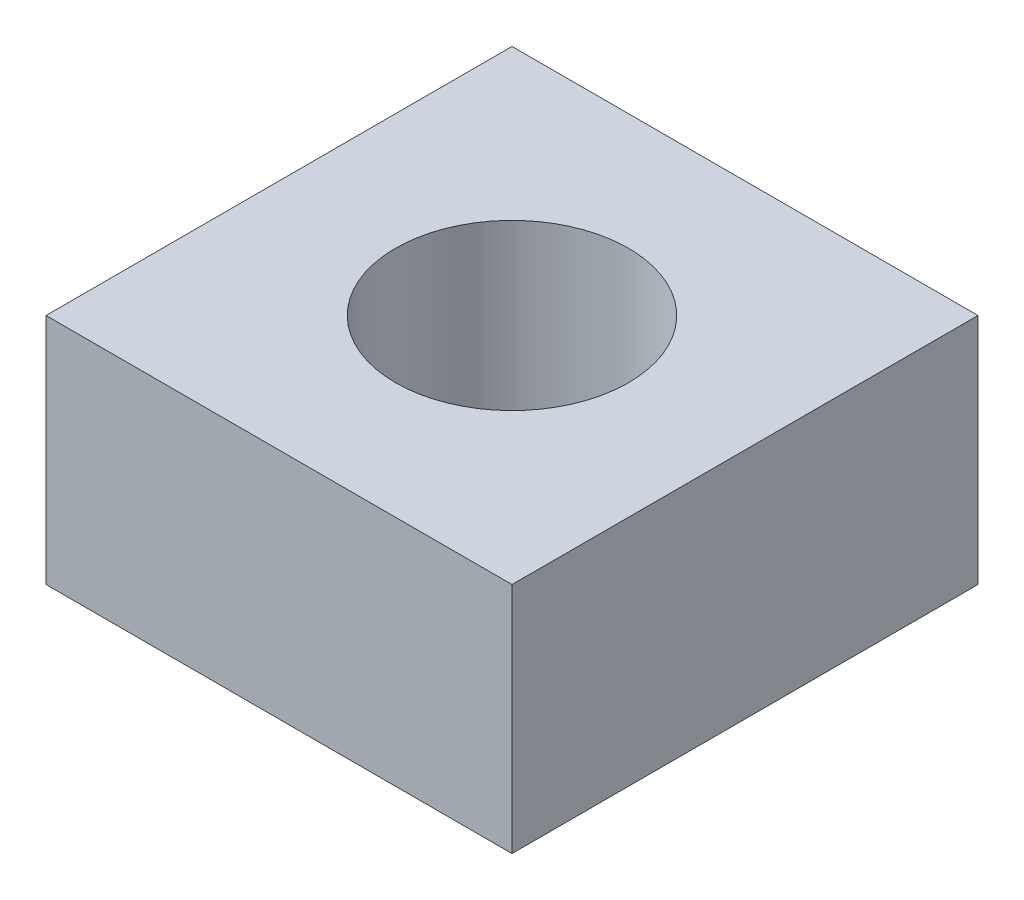
ISO-10303-21;
HEADER;
FILE_DESCRIPTION(('STEP AP214'),'2;1');
FILE_NAME('part.step','',(''),(''),'','','');
FILE_SCHEMA(('AUTOMOTIVE_DESIGN { 1 0 10303 214 1 1 1 1 }'));
ENDSEC;
DATA;
#1=APPLICATION_CONTEXT('core data for automotive mechanical design processes');
#2=APPLICATION_PROTOCOL_DEFINITION('international standard','automotive_design',2000,#1);
#3=PRODUCT_CONTEXT('',#1,'mechanical');
#4=PRODUCT('Part','Part','',(#3));
#5=PRODUCT_RELATED_PRODUCT_CATEGORY('part','',(#4));
#6=PRODUCT_DEFINITION_FORMATION('','',#4);
#7=PRODUCT_DEFINITION_CONTEXT('part definition',#1,'design');
#8=PRODUCT_DEFINITION('design','',#6,#7);
#9=PRODUCT_DEFINITION_SHAPE('','',#8);
#10=(LENGTH_UNIT() NAMED_UNIT(*) SI_UNIT(.MILLI.,.METRE.));
#11=(NAMED_UNIT(*) PLANE_ANGLE_UNIT() SI_UNIT($,.RADIAN.));
#12=(NAMED_UNIT(*) SI_UNIT($,.STERADIAN.) SOLID_ANGLE_UNIT());
#13=UNCERTAINTY_MEASURE_WITH_UNIT(LENGTH_MEASURE(1.E-05),#10,'distance_accuracy_value','');
#14=(GEOMETRIC_REPRESENTATION_CONTEXT(3) GLOBAL_UNCERTAINTY_ASSIGNED_CONTEXT((#13)) GLOBAL_UNIT_ASSIGNED_CONTEXT((#10,
#11,#12)) REPRESENTATION_CONTEXT('',''));
#15=CARTESIAN_POINT('',(0.,0.,0.));
#16=DIRECTION('',(0.,0.,1.));
#17=DIRECTION('',(1.,0.,0.));
#18=AXIS2_PLACEMENT_3D('',#15,#16,#17);
#19=CARTESIAN_POINT('',(0.,10.,0.));
#20=DIRECTION('',(0.,1.,0.));
#21=DIRECTION('',(0.,0.,1.));
#22=AXIS2_PLACEMENT_3D('',#19,#20,#21);
#23=PLANE('',#22);
#24=DIRECTION('',(0.,0.,-1.));
#25=VECTOR('',#24,1.);
#26=CARTESIAN_POINT('',(10.,10.,-10.));
#27=LINE('',#26,#25);
#28=CARTESIAN_POINT('',(10.,10.,10.));
#29=VERTEX_POINT('',#28);
#30=CARTESIAN_POINT('',(10.,10.,-10.));
#31=VERTEX_POINT('',#30);
#32=EDGE_CURVE('E98',#29,#31,#27,.T.);
#33=ORIENTED_EDGE('',*,*,#32,.T.);
#34=DIRECTION('',(-1.,0.,0.));
#35=VECTOR('',#34,1.);
#36=CARTESIAN_POINT('',(-10.,10.,-10.));
#37=LINE('',#36,#35);
#38=CARTESIAN_POINT('',(-10.,10.,-10.));
#39=VERTEX_POINT('',#38);
#40=EDGE_CURVE('E93',#31,#39,#37,.T.);
#41=ORIENTED_EDGE('',*,*,#40,.T.);
#42=DIRECTION('',(0.,0.,1.));
#43=VECTOR('',#42,1.);
#44=CARTESIAN_POINT('',(-10.,10.,-10.));
#45=LINE('',#44,#43);
#46=CARTESIAN_POINT('',(-10.,10.,10.));
#47=VERTEX_POINT('',#46);
#48=EDGE_CURVE('E96',#39,#47,#45,.T.);
#49=ORIENTED_EDGE('',*,*,#48,.T.);
#50=DIRECTION('',(1.,0.,0.));
#51=VECTOR('',#50,1.);
#52=CARTESIAN_POINT('',(-10.,10.,10.));
#53=LINE('',#52,#51);
#54=EDGE_CURVE('E63',#47,#29,#53,.T.);
#55=ORIENTED_EDGE('',*,*,#54,.T.);
#56=EDGE_LOOP('',(#33,#41,#49,#55));
#57=FACE_BOUND('',#56,.T.);
#58=CARTESIAN_POINT('',(0.,10.,0.));
#59=DIRECTION('',(0.,1.,0.));
#60=DIRECTION('',(0.,0.,1.));
#61=AXIS2_PLACEMENT_3D('',#58,#59,#60);
#62=CIRCLE('',#61,5.);
#63=CARTESIAN_POINT('',(0.,10.,5.));
#64=VERTEX_POINT('',#63);
#65=EDGE_CURVE('E118',#64,#64,#62,.T.);
#66=ORIENTED_EDGE('',*,*,#65,.F.);
#67=EDGE_LOOP('',(#66));
#68=FACE_BOUND('',#67,.T.);
#69=ADVANCED_FACE('F45',(#57,#68),#23,.T.);
#70=CARTESIAN_POINT('',(0.,0.,0.));
#71=DIRECTION('',(0.,1.,0.));
#72=DIRECTION('',(0.,0.,1.));
#73=AXIS2_PLACEMENT_3D('',#70,#71,#72);
#74=PLANE('',#73);
#75=DIRECTION('',(0.,0.,-1.));
#76=VECTOR('',#75,1.);
#77=CARTESIAN_POINT('',(10.,0.,-10.));
#78=LINE('',#77,#76);
#79=CARTESIAN_POINT('',(10.,0.,10.));
#80=VERTEX_POINT('',#79);
#81=CARTESIAN_POINT('',(10.,0.,-10.));
#82=VERTEX_POINT('',#81);
#83=EDGE_CURVE('E114',#80,#82,#78,.T.);
#84=ORIENTED_EDGE('',*,*,#83,.F.);
#85=DIRECTION('',(1.,0.,0.));
#86=VECTOR('',#85,1.);
#87=CARTESIAN_POINT('',(-10.,0.,10.));
#88=LINE('',#87,#86);
#89=CARTESIAN_POINT('',(-10.,0.,10.));
#90=VERTEX_POINT('',#89);
#91=EDGE_CURVE('E86',#90,#80,#88,.T.);
#92=ORIENTED_EDGE('',*,*,#91,.F.);
#93=DIRECTION('',(0.,0.,1.));
#94=VECTOR('',#93,1.);
#95=CARTESIAN_POINT('',(-10.,0.,-10.));
#96=LINE('',#95,#94);
#97=CARTESIAN_POINT('',(-10.,0.,-10.));
#98=VERTEX_POINT('',#97);
#99=EDGE_CURVE('E80',#98,#90,#96,.T.);
#100=ORIENTED_EDGE('',*,*,#99,.F.);
#101=DIRECTION('',(-1.,0.,0.));
#102=VECTOR('',#101,1.);
#103=CARTESIAN_POINT('',(-10.,0.,-10.));
#104=LINE('',#103,#102);
#105=EDGE_CURVE('E103',#82,#98,#104,.T.);
#106=ORIENTED_EDGE('',*,*,#105,.F.);
#107=EDGE_LOOP('',(#84,#92,#100,#106));
#108=FACE_BOUND('',#107,.T.);
#109=CARTESIAN_POINT('',(0.,0.,0.));
#110=DIRECTION('',(0.,1.,0.));
#111=DIRECTION('',(0.,0.,1.));
#112=AXIS2_PLACEMENT_3D('',#109,#110,#111);
#113=CIRCLE('',#112,5.);
#114=CARTESIAN_POINT('',(0.,0.,5.));
#115=VERTEX_POINT('',#114);
#116=EDGE_CURVE('E136',#115,#115,#113,.T.);
#117=ORIENTED_EDGE('',*,*,#116,.T.);
#118=EDGE_LOOP('',(#117));
#119=FACE_BOUND('',#118,.T.);
#120=ADVANCED_FACE('F131',(#108,#119),#74,.F.);
#121=CARTESIAN_POINT('',(10.,10.,-10.));
#122=DIRECTION('',(-1.,0.,0.));
#123=DIRECTION('',(0.,0.,1.));
#124=AXIS2_PLACEMENT_3D('',#121,#122,#123);
#125=PLANE('',#124);
#126=ORIENTED_EDGE('',*,*,#83,.T.);
#127=DIRECTION('',(0.,-1.,0.));
#128=VECTOR('',#127,1.);
#129=CARTESIAN_POINT('',(10.,10.,-10.));
#130=LINE('',#129,#128);
#131=EDGE_CURVE('E11',#31,#82,#130,.T.);
#132=ORIENTED_EDGE('',*,*,#131,.F.);
#133=ORIENTED_EDGE('',*,*,#32,.F.);
#134=DIRECTION('',(0.,-1.,0.));
#135=VECTOR('',#134,1.);
#136=CARTESIAN_POINT('',(10.,10.,10.));
#137=LINE('',#136,#135);
#138=EDGE_CURVE('E110',#29,#80,#137,.T.);
#139=ORIENTED_EDGE('',*,*,#138,.T.);
#140=EDGE_LOOP('',(#126,#132,#133,#139));
#141=FACE_BOUND('',#140,.T.);
#142=ADVANCED_FACE('F47',(#141),#125,.F.);
#143=CARTESIAN_POINT('',(-10.,10.,-10.));
#144=DIRECTION('',(0.,0.,1.));
#145=DIRECTION('',(1.,0.,0.));
#146=AXIS2_PLACEMENT_3D('',#143,#144,#145);
#147=PLANE('',#146);
#148=ORIENTED_EDGE('',*,*,#105,.T.);
#149=DIRECTION('',(0.,-1.,0.));
#150=VECTOR('',#149,1.);
#151=CARTESIAN_POINT('',(-10.,10.,-10.));
#152=LINE('',#151,#150);
#153=EDGE_CURVE('E55',#39,#98,#152,.T.);
#154=ORIENTED_EDGE('',*,*,#153,.F.);
#155=ORIENTED_EDGE('',*,*,#40,.F.);
#156=ORIENTED_EDGE('',*,*,#131,.T.);
#157=EDGE_LOOP('',(#148,#154,#155,#156));
#158=FACE_BOUND('',#157,.T.);
#159=ADVANCED_FACE('F102',(#158),#147,.F.);
#160=CARTESIAN_POINT('',(-10.,10.,-10.));
#161=DIRECTION('',(1.,0.,0.));
#162=DIRECTION('',(0.,0.,-1.));
#163=AXIS2_PLACEMENT_3D('',#160,#161,#162);
#164=PLANE('',#163);
#165=ORIENTED_EDGE('',*,*,#99,.T.);
#166=DIRECTION('',(0.,-1.,0.));
#167=VECTOR('',#166,1.);
#168=CARTESIAN_POINT('',(-10.,10.,10.));
#169=LINE('',#168,#167);
#170=EDGE_CURVE('E105',#47,#90,#169,.T.);
#171=ORIENTED_EDGE('',*,*,#170,.F.);
#172=ORIENTED_EDGE('',*,*,#48,.F.);
#173=ORIENTED_EDGE('',*,*,#153,.T.);
#174=EDGE_LOOP('',(#165,#171,#172,#173));
#175=FACE_BOUND('',#174,.T.);
#176=ADVANCED_FACE('F106',(#175),#164,.F.);
#177=CARTESIAN_POINT('',(-10.,10.,10.));
#178=DIRECTION('',(0.,0.,-1.));
#179=DIRECTION('',(-1.,0.,0.));
#180=AXIS2_PLACEMENT_3D('',#177,#178,#179);
#181=PLANE('',#180);
#182=ORIENTED_EDGE('',*,*,#91,.T.);
#183=ORIENTED_EDGE('',*,*,#138,.F.);
#184=ORIENTED_EDGE('',*,*,#54,.F.);
#185=ORIENTED_EDGE('',*,*,#170,.T.);
#186=EDGE_LOOP('',(#182,#183,#184,#185));
#187=FACE_BOUND('',#186,.T.);
#188=ADVANCED_FACE('F128',(#187),#181,.F.);
#189=CARTESIAN_POINT('',(0.,10.,0.));
#190=DIRECTION('',(0.,-1.,0.));
#191=DIRECTION('',(0.,0.,-1.));
#192=AXIS2_PLACEMENT_3D('',#189,#190,#191);
#193=CYLINDRICAL_SURFACE('',#192,5.);
#194=ORIENTED_EDGE('',*,*,#65,.T.);
#195=EDGE_LOOP('',(#194));
#196=FACE_BOUND('',#195,.T.);
#197=ORIENTED_EDGE('',*,*,#116,.F.);
#198=EDGE_LOOP('',(#197));
#199=FACE_BOUND('',#198,.T.);
#200=ADVANCED_FACE('F144',(#196,#199),#193,.F.);
#201=CLOSED_SHELL('',(#69,#120,#142,#159,#176,#188,#200));
#202=MANIFOLD_SOLID_BREP('B2',#201);
#203=ADVANCED_BREP_SHAPE_REPRESENTATION('',(#18,#202),#14);
#204=SHAPE_DEFINITION_REPRESENTATION(#9,#203);
ENDSEC;
END-ISO-10303-21;
